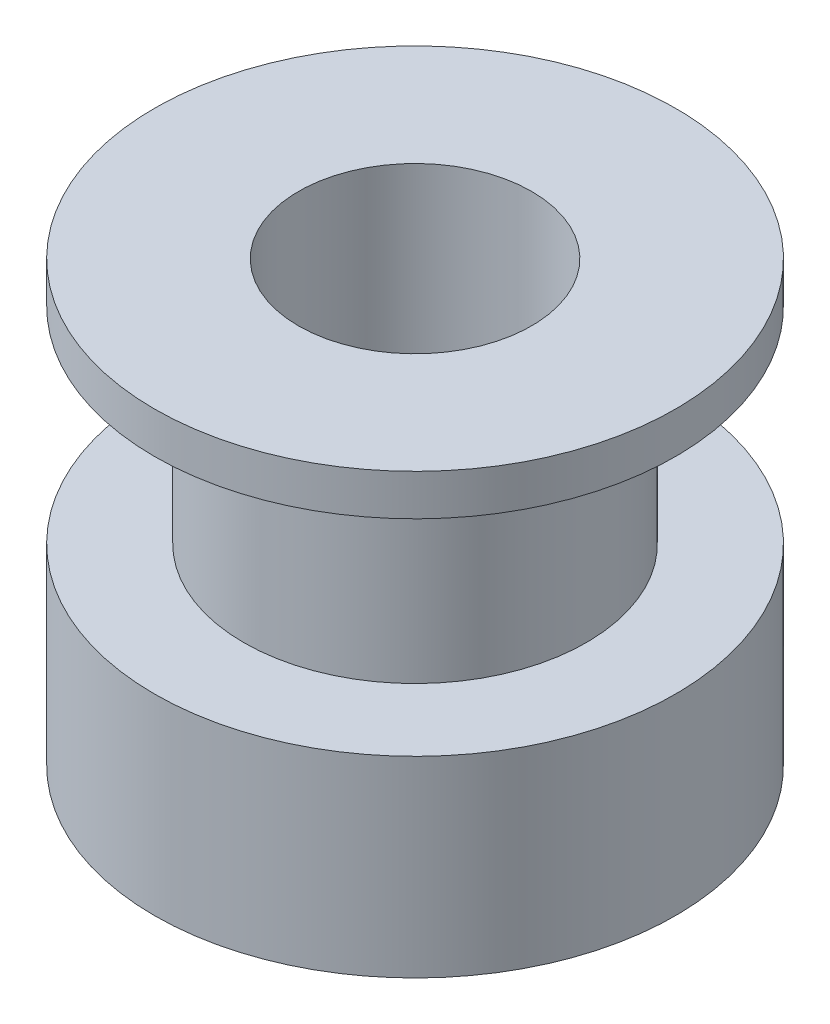
ISO-10303-21;
HEADER;
FILE_DESCRIPTION(('STEP AP214'),'2;1');
FILE_NAME('part.step','',(''),(''),'','','');
FILE_SCHEMA(('AUTOMOTIVE_DESIGN { 1 0 10303 214 1 1 1 1 }'));
ENDSEC;
DATA;
#1=APPLICATION_CONTEXT('core data for automotive mechanical design processes');
#2=APPLICATION_PROTOCOL_DEFINITION('international standard','automotive_design',2000,#1);
#3=PRODUCT_CONTEXT('',#1,'mechanical');
#4=PRODUCT('Part','Part','',(#3));
#5=PRODUCT_RELATED_PRODUCT_CATEGORY('part','',(#4));
#6=PRODUCT_DEFINITION_FORMATION('','',#4);
#7=PRODUCT_DEFINITION_CONTEXT('part definition',#1,'design');
#8=PRODUCT_DEFINITION('design','',#6,#7);
#9=PRODUCT_DEFINITION_SHAPE('','',#8);
#10=(LENGTH_UNIT() NAMED_UNIT(*) SI_UNIT(.MILLI.,.METRE.));
#11=(NAMED_UNIT(*) PLANE_ANGLE_UNIT() SI_UNIT($,.RADIAN.));
#12=(NAMED_UNIT(*) SI_UNIT($,.STERADIAN.) SOLID_ANGLE_UNIT());
#13=UNCERTAINTY_MEASURE_WITH_UNIT(LENGTH_MEASURE(1.E-05),#10,'distance_accuracy_value','');
#14=(GEOMETRIC_REPRESENTATION_CONTEXT(3) GLOBAL_UNCERTAINTY_ASSIGNED_CONTEXT((#13)) GLOBAL_UNIT_ASSIGNED_CONTEXT((#10,
#11,#12)) REPRESENTATION_CONTEXT('',''));
#15=CARTESIAN_POINT('',(0.,0.,0.));
#16=DIRECTION('',(0.,0.,1.));
#17=DIRECTION('',(1.,0.,0.));
#18=AXIS2_PLACEMENT_3D('',#15,#16,#17);
#19=CARTESIAN_POINT('',(0.,7.,0.));
#20=DIRECTION('',(0.,-1.,0.));
#21=DIRECTION('',(0.,0.,-1.));
#22=AXIS2_PLACEMENT_3D('',#19,#20,#21);
#23=CYLINDRICAL_SURFACE('',#22,9.5);
#24=CARTESIAN_POINT('',(0.,7.,0.));
#25=DIRECTION('',(0.,1.,0.));
#26=DIRECTION('',(0.,0.,1.));
#27=AXIS2_PLACEMENT_3D('',#24,#25,#26);
#28=CIRCLE('',#27,9.5);
#29=CARTESIAN_POINT('',(0.,7.,9.5));
#30=VERTEX_POINT('',#29);
#31=EDGE_CURVE('E39',#30,#30,#28,.T.);
#32=ORIENTED_EDGE('',*,*,#31,.F.);
#33=EDGE_LOOP('',(#32));
#34=FACE_BOUND('',#33,.T.);
#35=CARTESIAN_POINT('',(0.,0.,0.));
#36=DIRECTION('',(0.,1.,0.));
#37=DIRECTION('',(0.,0.,1.));
#38=AXIS2_PLACEMENT_3D('',#35,#36,#37);
#39=CIRCLE('',#38,9.5);
#40=CARTESIAN_POINT('',(0.,0.,9.5));
#41=VERTEX_POINT('',#40);
#42=EDGE_CURVE('E35',#41,#41,#39,.T.);
#43=ORIENTED_EDGE('',*,*,#42,.T.);
#44=EDGE_LOOP('',(#43));
#45=FACE_BOUND('',#44,.T.);
#46=ADVANCED_FACE('F32',(#34,#45),#23,.T.);
#47=CARTESIAN_POINT('',(0.,7.,0.));
#48=DIRECTION('',(0.,1.,0.));
#49=DIRECTION('',(0.,0.,1.));
#50=AXIS2_PLACEMENT_3D('',#47,#48,#49);
#51=PLANE('',#50);
#52=CARTESIAN_POINT('',(0.,7.,0.));
#53=DIRECTION('',(0.,1.,0.));
#54=DIRECTION('',(0.,0.,1.));
#55=AXIS2_PLACEMENT_3D('',#52,#53,#54);
#56=CIRCLE('',#55,6.25);
#57=CARTESIAN_POINT('',(0.,7.,6.25));
#58=VERTEX_POINT('',#57);
#59=EDGE_CURVE('E10',#58,#58,#56,.T.);
#60=ORIENTED_EDGE('',*,*,#59,.F.);
#61=EDGE_LOOP('',(#60));
#62=FACE_BOUND('',#61,.T.);
#63=ORIENTED_EDGE('',*,*,#31,.T.);
#64=EDGE_LOOP('',(#63));
#65=FACE_BOUND('',#64,.T.);
#66=ADVANCED_FACE('F90',(#62,#65),#51,.T.);
#67=CARTESIAN_POINT('',(0.,0.,0.));
#68=DIRECTION('',(0.,1.,0.));
#69=DIRECTION('',(0.,0.,1.));
#70=AXIS2_PLACEMENT_3D('',#67,#68,#69);
#71=PLANE('',#70);
#72=CARTESIAN_POINT('',(0.,0.,0.));
#73=DIRECTION('',(0.,1.,0.));
#74=DIRECTION('',(0.,0.,1.));
#75=AXIS2_PLACEMENT_3D('',#72,#73,#74);
#76=CIRCLE('',#75,4.25);
#77=CARTESIAN_POINT('',(0.,0.,4.25));
#78=VERTEX_POINT('',#77);
#79=EDGE_CURVE('E52',#78,#78,#76,.T.);
#80=ORIENTED_EDGE('',*,*,#79,.T.);
#81=EDGE_LOOP('',(#80));
#82=FACE_BOUND('',#81,.T.);
#83=ORIENTED_EDGE('',*,*,#42,.F.);
#84=EDGE_LOOP('',(#83));
#85=FACE_BOUND('',#84,.T.);
#86=ADVANCED_FACE('F61',(#82,#85),#71,.F.);
#87=CARTESIAN_POINT('',(0.,14.5,0.));
#88=DIRECTION('',(0.,-1.,0.));
#89=DIRECTION('',(0.,0.,-1.));
#90=AXIS2_PLACEMENT_3D('',#87,#88,#89);
#91=CYLINDRICAL_SURFACE('',#90,6.25);
#92=CARTESIAN_POINT('',(0.,14.5,0.));
#93=DIRECTION('',(0.,1.,0.));
#94=DIRECTION('',(0.,0.,1.));
#95=AXIS2_PLACEMENT_3D('',#92,#93,#94);
#96=CIRCLE('',#95,6.25);
#97=CARTESIAN_POINT('',(0.,14.5,6.25));
#98=VERTEX_POINT('',#97);
#99=EDGE_CURVE('E45',#98,#98,#96,.T.);
#100=ORIENTED_EDGE('',*,*,#99,.F.);
#101=EDGE_LOOP('',(#100));
#102=FACE_BOUND('',#101,.T.);
#103=ORIENTED_EDGE('',*,*,#59,.T.);
#104=EDGE_LOOP('',(#103));
#105=FACE_BOUND('',#104,.T.);
#106=ADVANCED_FACE('F80',(#102,#105),#91,.T.);
#107=CARTESIAN_POINT('',(0.,16.,0.));
#108=DIRECTION('',(0.,-1.,0.));
#109=DIRECTION('',(0.,0.,-1.));
#110=AXIS2_PLACEMENT_3D('',#107,#108,#109);
#111=CYLINDRICAL_SURFACE('',#110,9.5);
#112=CARTESIAN_POINT('',(0.,16.,0.));
#113=DIRECTION('',(0.,1.,0.));
#114=DIRECTION('',(0.,0.,1.));
#115=AXIS2_PLACEMENT_3D('',#112,#113,#114);
#116=CIRCLE('',#115,9.5);
#117=CARTESIAN_POINT('',(0.,16.,9.5));
#118=VERTEX_POINT('',#117);
#119=EDGE_CURVE('E48',#118,#118,#116,.T.);
#120=ORIENTED_EDGE('',*,*,#119,.F.);
#121=EDGE_LOOP('',(#120));
#122=FACE_BOUND('',#121,.T.);
#123=CARTESIAN_POINT('',(0.,14.5,0.));
#124=DIRECTION('',(0.,1.,0.));
#125=DIRECTION('',(0.,0.,1.));
#126=AXIS2_PLACEMENT_3D('',#123,#124,#125);
#127=CIRCLE('',#126,9.5);
#128=CARTESIAN_POINT('',(0.,14.5,9.5));
#129=VERTEX_POINT('',#128);
#130=EDGE_CURVE('E49',#129,#129,#127,.T.);
#131=ORIENTED_EDGE('',*,*,#130,.T.);
#132=EDGE_LOOP('',(#131));
#133=FACE_BOUND('',#132,.T.);
#134=ADVANCED_FACE('F74',(#122,#133),#111,.T.);
#135=CARTESIAN_POINT('',(0.,16.,0.));
#136=DIRECTION('',(0.,1.,0.));
#137=DIRECTION('',(0.,0.,1.));
#138=AXIS2_PLACEMENT_3D('',#135,#136,#137);
#139=PLANE('',#138);
#140=CARTESIAN_POINT('',(0.,16.,0.));
#141=DIRECTION('',(0.,1.,0.));
#142=DIRECTION('',(0.,0.,1.));
#143=AXIS2_PLACEMENT_3D('',#140,#141,#142);
#144=CIRCLE('',#143,4.25);
#145=CARTESIAN_POINT('',(0.,16.,4.25));
#146=VERTEX_POINT('',#145);
#147=EDGE_CURVE('E55',#146,#146,#144,.T.);
#148=ORIENTED_EDGE('',*,*,#147,.F.);
#149=EDGE_LOOP('',(#148));
#150=FACE_BOUND('',#149,.T.);
#151=ORIENTED_EDGE('',*,*,#119,.T.);
#152=EDGE_LOOP('',(#151));
#153=FACE_BOUND('',#152,.T.);
#154=ADVANCED_FACE('F71',(#150,#153),#139,.T.);
#155=CARTESIAN_POINT('',(0.,14.5,0.));
#156=DIRECTION('',(0.,1.,0.));
#157=DIRECTION('',(0.,0.,1.));
#158=AXIS2_PLACEMENT_3D('',#155,#156,#157);
#159=PLANE('',#158);
#160=ORIENTED_EDGE('',*,*,#99,.T.);
#161=EDGE_LOOP('',(#160));
#162=FACE_BOUND('',#161,.T.);
#163=ORIENTED_EDGE('',*,*,#130,.F.);
#164=EDGE_LOOP('',(#163));
#165=FACE_BOUND('',#164,.T.);
#166=ADVANCED_FACE('F67',(#162,#165),#159,.F.);
#167=CARTESIAN_POINT('',(0.,0.,0.));
#168=DIRECTION('',(0.,1.,0.));
#169=DIRECTION('',(0.,0.,1.));
#170=AXIS2_PLACEMENT_3D('',#167,#168,#169);
#171=CYLINDRICAL_SURFACE('',#170,4.25);
#172=ORIENTED_EDGE('',*,*,#79,.F.);
#173=EDGE_LOOP('',(#172));
#174=FACE_BOUND('',#173,.T.);
#175=ORIENTED_EDGE('',*,*,#147,.T.);
#176=EDGE_LOOP('',(#175));
#177=FACE_BOUND('',#176,.T.);
#178=ADVANCED_FACE('F64',(#174,#177),#171,.F.);
#179=CLOSED_SHELL('',(#46,#66,#86,#106,#134,#154,#166,#178));
#180=MANIFOLD_SOLID_BREP('B2',#179);
#181=ADVANCED_BREP_SHAPE_REPRESENTATION('',(#18,#180),#14);
#182=SHAPE_DEFINITION_REPRESENTATION(#9,#181);
ENDSEC;
END-ISO-10303-21;
